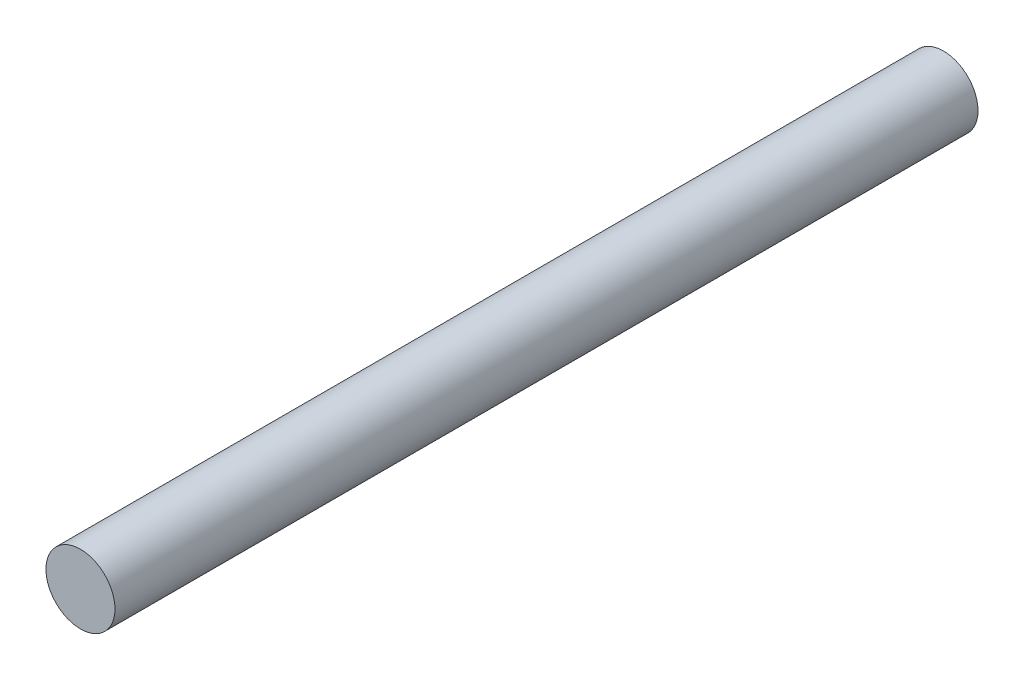
ISO-10303-21;
HEADER;
FILE_DESCRIPTION(('STEP AP214'),'2;1');
FILE_NAME('part.step','',(''),(''),'','','');
FILE_SCHEMA(('AUTOMOTIVE_DESIGN { 1 0 10303 214 1 1 1 1 }'));
ENDSEC;
DATA;
#1=APPLICATION_CONTEXT('core data for automotive mechanical design processes');
#2=APPLICATION_PROTOCOL_DEFINITION('international standard','automotive_design',2000,#1);
#3=PRODUCT_CONTEXT('',#1,'mechanical');
#4=PRODUCT('Part','Part','',(#3));
#5=PRODUCT_RELATED_PRODUCT_CATEGORY('part','',(#4));
#6=PRODUCT_DEFINITION_FORMATION('','',#4);
#7=PRODUCT_DEFINITION_CONTEXT('part definition',#1,'design');
#8=PRODUCT_DEFINITION('design','',#6,#7);
#9=PRODUCT_DEFINITION_SHAPE('','',#8);
#10=(LENGTH_UNIT() NAMED_UNIT(*) SI_UNIT(.MILLI.,.METRE.));
#11=(NAMED_UNIT(*) PLANE_ANGLE_UNIT() SI_UNIT($,.RADIAN.));
#12=(NAMED_UNIT(*) SI_UNIT($,.STERADIAN.) SOLID_ANGLE_UNIT());
#13=UNCERTAINTY_MEASURE_WITH_UNIT(LENGTH_MEASURE(1.E-05),#10,'distance_accuracy_value','');
#14=(GEOMETRIC_REPRESENTATION_CONTEXT(3) GLOBAL_UNCERTAINTY_ASSIGNED_CONTEXT((#13)) GLOBAL_UNIT_ASSIGNED_CONTEXT((#10,
#11,#12)) REPRESENTATION_CONTEXT('',''));
#15=CARTESIAN_POINT('',(0.,0.,0.));
#16=DIRECTION('',(0.,0.,1.));
#17=DIRECTION('',(1.,0.,0.));
#18=AXIS2_PLACEMENT_3D('',#15,#16,#17);
#19=CARTESIAN_POINT('',(33.9698750895799,0.,100.));
#20=DIRECTION('',(0.,0.,-1.));
#21=DIRECTION('',(-1.,0.,0.));
#22=AXIS2_PLACEMENT_3D('',#19,#20,#21);
#23=CYLINDRICAL_SURFACE('',#22,4.);
#24=CARTESIAN_POINT('',(33.9698750895799,0.,100.));
#25=DIRECTION('',(0.,0.,1.));
#26=DIRECTION('',(1.,0.,0.));
#27=AXIS2_PLACEMENT_3D('',#24,#25,#26);
#28=CIRCLE('',#27,4.);
#29=CARTESIAN_POINT('',(37.9698750895799,0.,100.));
#30=VERTEX_POINT('',#29);
#31=EDGE_CURVE('E10',#30,#30,#28,.T.);
#32=ORIENTED_EDGE('',*,*,#31,.F.);
#33=EDGE_LOOP('',(#32));
#34=FACE_BOUND('',#33,.T.);
#35=CARTESIAN_POINT('',(33.9698750895799,0.,0.));
#36=DIRECTION('',(0.,0.,1.));
#37=DIRECTION('',(1.,0.,0.));
#38=AXIS2_PLACEMENT_3D('',#35,#36,#37);
#39=CIRCLE('',#38,4.);
#40=CARTESIAN_POINT('',(37.9698750895799,0.,0.));
#41=VERTEX_POINT('',#40);
#42=EDGE_CURVE('E34',#41,#41,#39,.T.);
#43=ORIENTED_EDGE('',*,*,#42,.T.);
#44=EDGE_LOOP('',(#43));
#45=FACE_BOUND('',#44,.T.);
#46=ADVANCED_FACE('F31',(#34,#45),#23,.T.);
#47=CARTESIAN_POINT('',(33.9698750895799,0.,100.));
#48=DIRECTION('',(0.,0.,1.));
#49=DIRECTION('',(1.,0.,0.));
#50=AXIS2_PLACEMENT_3D('',#47,#48,#49);
#51=PLANE('',#50);
#52=ORIENTED_EDGE('',*,*,#31,.T.);
#53=EDGE_LOOP('',(#52));
#54=FACE_BOUND('',#53,.T.);
#55=ADVANCED_FACE('F46',(#54),#51,.T.);
#56=CARTESIAN_POINT('',(33.9698750895799,0.,0.));
#57=DIRECTION('',(0.,0.,1.));
#58=DIRECTION('',(1.,0.,0.));
#59=AXIS2_PLACEMENT_3D('',#56,#57,#58);
#60=PLANE('',#59);
#61=ORIENTED_EDGE('',*,*,#42,.F.);
#62=EDGE_LOOP('',(#61));
#63=FACE_BOUND('',#62,.T.);
#64=ADVANCED_FACE('F44',(#63),#60,.F.);
#65=CLOSED_SHELL('',(#46,#55,#64));
#66=MANIFOLD_SOLID_BREP('B2',#65);
#67=ADVANCED_BREP_SHAPE_REPRESENTATION('',(#18,#66),#14);
#68=SHAPE_DEFINITION_REPRESENTATION(#9,#67);
ENDSEC;
END-ISO-10303-21;
